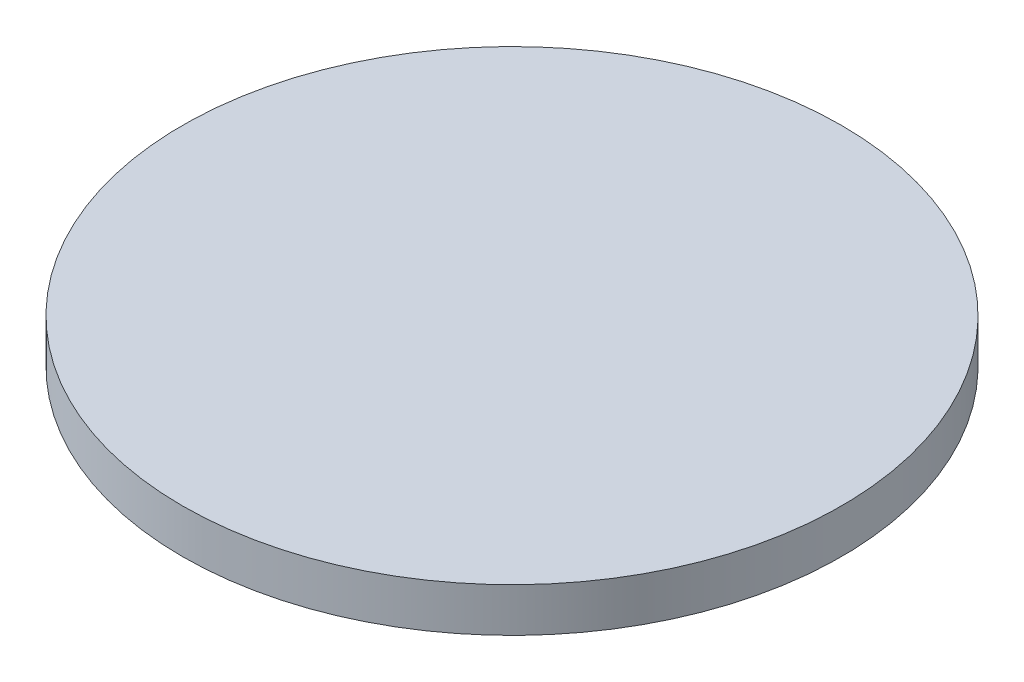
ISO-10303-21;
HEADER;
FILE_DESCRIPTION(('STEP AP214'),'2;1');
FILE_NAME('part.step','',(''),(''),'','','');
FILE_SCHEMA(('AUTOMOTIVE_DESIGN { 1 0 10303 214 1 1 1 1 }'));
ENDSEC;
DATA;
#1=APPLICATION_CONTEXT('core data for automotive mechanical design processes');
#2=APPLICATION_PROTOCOL_DEFINITION('international standard','automotive_design',2000,#1);
#3=PRODUCT_CONTEXT('',#1,'mechanical');
#4=PRODUCT('Part','Part','',(#3));
#5=PRODUCT_RELATED_PRODUCT_CATEGORY('part','',(#4));
#6=PRODUCT_DEFINITION_FORMATION('','',#4);
#7=PRODUCT_DEFINITION_CONTEXT('part definition',#1,'design');
#8=PRODUCT_DEFINITION('design','',#6,#7);
#9=PRODUCT_DEFINITION_SHAPE('','',#8);
#10=(LENGTH_UNIT() NAMED_UNIT(*) SI_UNIT(.MILLI.,.METRE.));
#11=(NAMED_UNIT(*) PLANE_ANGLE_UNIT() SI_UNIT($,.RADIAN.));
#12=(NAMED_UNIT(*) SI_UNIT($,.STERADIAN.) SOLID_ANGLE_UNIT());
#13=UNCERTAINTY_MEASURE_WITH_UNIT(LENGTH_MEASURE(1.E-05),#10,'distance_accuracy_value','');
#14=(GEOMETRIC_REPRESENTATION_CONTEXT(3) GLOBAL_UNCERTAINTY_ASSIGNED_CONTEXT((#13)) GLOBAL_UNIT_ASSIGNED_CONTEXT((#10,
#11,#12)) REPRESENTATION_CONTEXT('',''));
#15=CARTESIAN_POINT('',(0.,0.,0.));
#16=DIRECTION('',(0.,0.,1.));
#17=DIRECTION('',(1.,0.,0.));
#18=AXIS2_PLACEMENT_3D('',#15,#16,#17);
#19=CARTESIAN_POINT('',(0.,3.9,0.));
#20=DIRECTION('',(0.,1.,0.));
#21=DIRECTION('',(0.,0.,1.));
#22=AXIS2_PLACEMENT_3D('',#19,#20,#21);
#23=PLANE('',#22);
#24=CARTESIAN_POINT('',(0.,3.9,0.));
#25=DIRECTION('',(0.,1.,0.));
#26=DIRECTION('',(0.,0.,1.));
#27=AXIS2_PLACEMENT_3D('',#24,#25,#26);
#28=CIRCLE('',#27,15.);
#29=CARTESIAN_POINT('',(0.,3.9,15.));
#30=VERTEX_POINT('',#29);
#31=EDGE_CURVE('E10',#30,#30,#28,.T.);
#32=ORIENTED_EDGE('',*,*,#31,.T.);
#33=EDGE_LOOP('',(#32));
#34=FACE_BOUND('',#33,.T.);
#35=ADVANCED_FACE('F39',(#34),#23,.T.);
#36=CARTESIAN_POINT('',(0.,3.9,0.));
#37=DIRECTION('',(0.,1.,0.));
#38=DIRECTION('',(0.,0.,1.));
#39=AXIS2_PLACEMENT_3D('',#36,#37,#38);
#40=CYLINDRICAL_SURFACE('',#39,15.);
#41=CARTESIAN_POINT('',(0.,1.9,0.));
#42=DIRECTION('',(0.,1.,0.));
#43=DIRECTION('',(0.,0.,1.));
#44=AXIS2_PLACEMENT_3D('',#41,#42,#43);
#45=CIRCLE('',#44,15.);
#46=CARTESIAN_POINT('',(0.,1.9,15.));
#47=VERTEX_POINT('',#46);
#48=EDGE_CURVE('E46',#47,#47,#45,.T.);
#49=ORIENTED_EDGE('',*,*,#48,.T.);
#50=EDGE_LOOP('',(#49));
#51=FACE_BOUND('',#50,.T.);
#52=ORIENTED_EDGE('',*,*,#31,.F.);
#53=EDGE_LOOP('',(#52));
#54=FACE_BOUND('',#53,.T.);
#55=ADVANCED_FACE('F94',(#51,#54),#40,.T.);
#56=CARTESIAN_POINT('',(-15.,1.9,0.));
#57=DIRECTION('',(0.,-1.,0.));
#58=DIRECTION('',(0.,0.,-1.));
#59=AXIS2_PLACEMENT_3D('',#56,#57,#58);
#60=PLANE('',#59);
#61=CARTESIAN_POINT('',(0.,1.9,0.));
#62=DIRECTION('',(0.,1.,0.));
#63=DIRECTION('',(0.,0.,1.));
#64=AXIS2_PLACEMENT_3D('',#61,#62,#63);
#65=CIRCLE('',#64,4.96);
#66=CARTESIAN_POINT('',(0.,1.9,4.96));
#67=VERTEX_POINT('',#66);
#68=EDGE_CURVE('E51',#67,#67,#65,.T.);
#69=ORIENTED_EDGE('',*,*,#68,.T.);
#70=EDGE_LOOP('',(#69));
#71=FACE_BOUND('',#70,.T.);
#72=ORIENTED_EDGE('',*,*,#48,.F.);
#73=EDGE_LOOP('',(#72));
#74=FACE_BOUND('',#73,.T.);
#75=ADVANCED_FACE('F88',(#71,#74),#60,.T.);
#76=CARTESIAN_POINT('',(0.,3.9,0.));
#77=DIRECTION('',(0.,1.,0.));
#78=DIRECTION('',(0.,0.,1.));
#79=AXIS2_PLACEMENT_3D('',#76,#77,#78);
#80=CYLINDRICAL_SURFACE('',#79,4.96);
#81=CARTESIAN_POINT('',(0.,0.,0.));
#82=DIRECTION('',(0.,1.,0.));
#83=DIRECTION('',(0.,0.,1.));
#84=AXIS2_PLACEMENT_3D('',#81,#82,#83);
#85=CIRCLE('',#84,4.96);
#86=CARTESIAN_POINT('',(0.,0.,4.96));
#87=VERTEX_POINT('',#86);
#88=EDGE_CURVE('E56',#87,#87,#85,.T.);
#89=ORIENTED_EDGE('',*,*,#88,.T.);
#90=EDGE_LOOP('',(#89));
#91=FACE_BOUND('',#90,.T.);
#92=ORIENTED_EDGE('',*,*,#68,.F.);
#93=EDGE_LOOP('',(#92));
#94=FACE_BOUND('',#93,.T.);
#95=ADVANCED_FACE('F82',(#91,#94),#80,.T.);
#96=CARTESIAN_POINT('',(-4.96,0.,0.));
#97=DIRECTION('',(0.,-1.,0.));
#98=DIRECTION('',(0.,0.,-1.));
#99=AXIS2_PLACEMENT_3D('',#96,#97,#98);
#100=PLANE('',#99);
#101=CARTESIAN_POINT('',(0.,0.,0.));
#102=DIRECTION('',(0.,-1.,0.));
#103=DIRECTION('',(0.,0.,-1.));
#104=AXIS2_PLACEMENT_3D('',#101,#102,#103);
#105=CIRCLE('',#104,2.81);
#106=CARTESIAN_POINT('',(0.,0.,-2.81));
#107=VERTEX_POINT('',#106);
#108=EDGE_CURVE('E63',#107,#107,#105,.T.);
#109=ORIENTED_EDGE('',*,*,#108,.F.);
#110=EDGE_LOOP('',(#109));
#111=FACE_BOUND('',#110,.T.);
#112=ORIENTED_EDGE('',*,*,#88,.F.);
#113=EDGE_LOOP('',(#112));
#114=FACE_BOUND('',#113,.T.);
#115=ADVANCED_FACE('F76',(#111,#114),#100,.T.);
#116=CARTESIAN_POINT('',(0.,3.03,0.));
#117=DIRECTION('',(0.,-1.,0.));
#118=DIRECTION('',(0.,0.,-1.));
#119=AXIS2_PLACEMENT_3D('',#116,#117,#118);
#120=CYLINDRICAL_SURFACE('',#119,2.81);
#121=CARTESIAN_POINT('',(0.,3.03,0.));
#122=DIRECTION('',(0.,-1.,0.));
#123=DIRECTION('',(0.,0.,-1.));
#124=AXIS2_PLACEMENT_3D('',#121,#122,#123);
#125=CIRCLE('',#124,2.81);
#126=CARTESIAN_POINT('',(0.,3.03,-2.81));
#127=VERTEX_POINT('',#126);
#128=EDGE_CURVE('E62',#127,#127,#125,.T.);
#129=ORIENTED_EDGE('',*,*,#128,.F.);
#130=EDGE_LOOP('',(#129));
#131=FACE_BOUND('',#130,.T.);
#132=ORIENTED_EDGE('',*,*,#108,.T.);
#133=EDGE_LOOP('',(#132));
#134=FACE_BOUND('',#133,.T.);
#135=ADVANCED_FACE('F73',(#131,#134),#120,.F.);
#136=CARTESIAN_POINT('',(0.,3.03,0.));
#137=DIRECTION('',(0.,-1.,0.));
#138=DIRECTION('',(0.,0.,-1.));
#139=AXIS2_PLACEMENT_3D('',#136,#137,#138);
#140=PLANE('',#139);
#141=ORIENTED_EDGE('',*,*,#128,.T.);
#142=EDGE_LOOP('',(#141));
#143=FACE_BOUND('',#142,.T.);
#144=ADVANCED_FACE('F71',(#143),#140,.T.);
#145=CLOSED_SHELL('',(#35,#55,#75,#95,#115,#135,#144));
#146=MANIFOLD_SOLID_BREP('B2',#145);
#147=ADVANCED_BREP_SHAPE_REPRESENTATION('',(#18,#146),#14);
#148=SHAPE_DEFINITION_REPRESENTATION(#9,#147);
ENDSEC;
END-ISO-10303-21;
